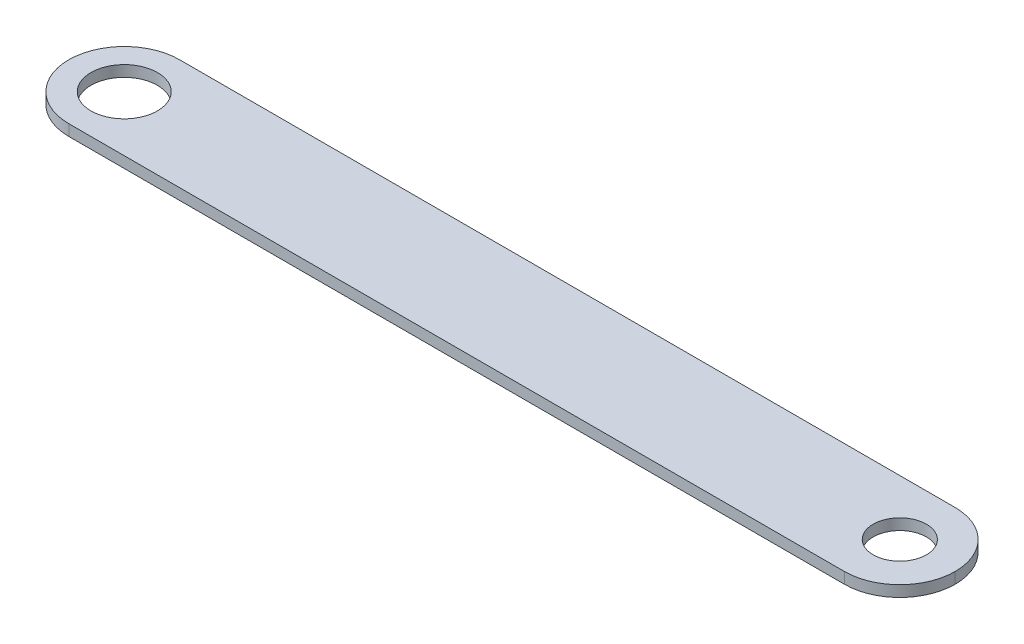
ISO-10303-21;
HEADER;
FILE_DESCRIPTION(('STEP AP214'),'2;1');
FILE_NAME('part.step','',(''),(''),'','','');
FILE_SCHEMA(('AUTOMOTIVE_DESIGN { 1 0 10303 214 1 1 1 1 }'));
ENDSEC;
DATA;
#1=APPLICATION_CONTEXT('core data for automotive mechanical design processes');
#2=APPLICATION_PROTOCOL_DEFINITION('international standard','automotive_design',2000,#1);
#3=PRODUCT_CONTEXT('',#1,'mechanical');
#4=PRODUCT('Part','Part','',(#3));
#5=PRODUCT_RELATED_PRODUCT_CATEGORY('part','',(#4));
#6=PRODUCT_DEFINITION_FORMATION('','',#4);
#7=PRODUCT_DEFINITION_CONTEXT('part definition',#1,'design');
#8=PRODUCT_DEFINITION('design','',#6,#7);
#9=PRODUCT_DEFINITION_SHAPE('','',#8);
#10=(LENGTH_UNIT() NAMED_UNIT(*) SI_UNIT(.MILLI.,.METRE.));
#11=(NAMED_UNIT(*) PLANE_ANGLE_UNIT() SI_UNIT($,.RADIAN.));
#12=(NAMED_UNIT(*) SI_UNIT($,.STERADIAN.) SOLID_ANGLE_UNIT());
#13=UNCERTAINTY_MEASURE_WITH_UNIT(LENGTH_MEASURE(1.E-05),#10,'distance_accuracy_value','');
#14=(GEOMETRIC_REPRESENTATION_CONTEXT(3) GLOBAL_UNCERTAINTY_ASSIGNED_CONTEXT((#13)) GLOBAL_UNIT_ASSIGNED_CONTEXT((#10,
#11,#12)) REPRESENTATION_CONTEXT('',''));
#15=CARTESIAN_POINT('',(0.,0.,0.));
#16=DIRECTION('',(0.,0.,1.));
#17=DIRECTION('',(1.,0.,0.));
#18=AXIS2_PLACEMENT_3D('',#15,#16,#17);
#19=CARTESIAN_POINT('',(0.,2.5,0.));
#20=DIRECTION('',(0.,1.,0.));
#21=DIRECTION('',(0.,0.,1.));
#22=AXIS2_PLACEMENT_3D('',#19,#20,#21);
#23=PLANE('',#22);
#24=CARTESIAN_POINT('',(-176.816523372745,2.5,-19.5438282647585));
#25=DIRECTION('',(0.,1.,0.));
#26=DIRECTION('',(0.,0.,1.));
#27=AXIS2_PLACEMENT_3D('',#24,#25,#26);
#28=CIRCLE('',#27,15.);
#29=CARTESIAN_POINT('',(-176.816523372745,2.5,-4.54382826475854));
#30=VERTEX_POINT('',#29);
#31=EDGE_CURVE('E166',#30,#30,#28,.T.);
#32=ORIENTED_EDGE('',*,*,#31,.F.);
#33=EDGE_LOOP('',(#32));
#34=FACE_BOUND('',#33,.T.);
#35=DIRECTION('',(1.,0.,0.));
#36=VECTOR('',#35,1.);
#37=CARTESIAN_POINT('',(-201.816523372745,2.5,5.45617173524147));
#38=LINE('',#37,#36);
#39=CARTESIAN_POINT('',(-176.816523372745,2.5,5.45617173524147));
#40=VERTEX_POINT('',#39);
#41=CARTESIAN_POINT('',(173.183476627255,2.5,5.45617173524147));
#42=VERTEX_POINT('',#41);
#43=EDGE_CURVE('E173',#40,#42,#38,.T.);
#44=ORIENTED_EDGE('',*,*,#43,.T.);
#45=CARTESIAN_POINT('',(173.183476627255,2.5,-19.5438282647585));
#46=DIRECTION('',(0.,1.,0.));
#47=DIRECTION('',(0.,0.,1.));
#48=AXIS2_PLACEMENT_3D('',#45,#46,#47);
#49=CIRCLE('',#48,25.);
#50=CARTESIAN_POINT('',(198.183476627255,2.5,-19.5438282647585));
#51=VERTEX_POINT('',#50);
#52=EDGE_CURVE('E145',#42,#51,#49,.T.);
#53=ORIENTED_EDGE('',*,*,#52,.T.);
#54=CARTESIAN_POINT('',(173.183476627255,2.5,-19.5438282647585));
#55=DIRECTION('',(0.,1.,0.));
#56=DIRECTION('',(0.,0.,1.));
#57=AXIS2_PLACEMENT_3D('',#54,#55,#56);
#58=CIRCLE('',#57,25.);
#59=CARTESIAN_POINT('',(173.183476627255,2.5,-44.5438282647585));
#60=VERTEX_POINT('',#59);
#61=EDGE_CURVE('E71',#51,#60,#58,.T.);
#62=ORIENTED_EDGE('',*,*,#61,.T.);
#63=DIRECTION('',(-1.,0.,0.));
#64=VECTOR('',#63,1.);
#65=CARTESIAN_POINT('',(-201.816523372745,2.5,-44.5438282647585));
#66=LINE('',#65,#64);
#67=CARTESIAN_POINT('',(-176.816523372745,2.5,-44.5438282647585));
#68=VERTEX_POINT('',#67);
#69=EDGE_CURVE('E115',#60,#68,#66,.T.);
#70=ORIENTED_EDGE('',*,*,#69,.T.);
#71=CARTESIAN_POINT('',(-176.816523372745,2.5,-19.5438282647585));
#72=DIRECTION('',(0.,1.,0.));
#73=DIRECTION('',(0.,0.,1.));
#74=AXIS2_PLACEMENT_3D('',#71,#72,#73);
#75=CIRCLE('',#74,25.);
#76=CARTESIAN_POINT('',(-201.816523372745,2.5,-19.5438282647585));
#77=VERTEX_POINT('',#76);
#78=EDGE_CURVE('E63',#68,#77,#75,.T.);
#79=ORIENTED_EDGE('',*,*,#78,.T.);
#80=CARTESIAN_POINT('',(-176.816523372745,2.5,-19.5438282647585));
#81=DIRECTION('',(0.,1.,0.));
#82=DIRECTION('',(0.,0.,1.));
#83=AXIS2_PLACEMENT_3D('',#80,#81,#82);
#84=CIRCLE('',#83,25.);
#85=EDGE_CURVE('E118',#77,#40,#84,.T.);
#86=ORIENTED_EDGE('',*,*,#85,.T.);
#87=EDGE_LOOP('',(#44,#53,#62,#70,#79,#86));
#88=FACE_BOUND('',#87,.T.);
#89=CARTESIAN_POINT('',(173.183476627255,2.5,-19.5438282647585));
#90=DIRECTION('',(0.,1.,0.));
#91=DIRECTION('',(0.,0.,1.));
#92=AXIS2_PLACEMENT_3D('',#89,#90,#91);
#93=CIRCLE('',#92,12.);
#94=CARTESIAN_POINT('',(173.183476627255,2.5,-7.54382826475853));
#95=VERTEX_POINT('',#94);
#96=EDGE_CURVE('E157',#95,#95,#93,.T.);
#97=ORIENTED_EDGE('',*,*,#96,.F.);
#98=EDGE_LOOP('',(#97));
#99=FACE_BOUND('',#98,.T.);
#100=ADVANCED_FACE('F45',(#34,#88,#99),#23,.T.);
#101=CARTESIAN_POINT('',(0.,-2.5,0.));
#102=DIRECTION('',(0.,1.,0.));
#103=DIRECTION('',(0.,0.,1.));
#104=AXIS2_PLACEMENT_3D('',#101,#102,#103);
#105=PLANE('',#104);
#106=CARTESIAN_POINT('',(173.183476627255,-2.5,-19.5438282647585));
#107=DIRECTION('',(0.,1.,0.));
#108=DIRECTION('',(0.,0.,1.));
#109=AXIS2_PLACEMENT_3D('',#106,#107,#108);
#110=CIRCLE('',#109,25.);
#111=CARTESIAN_POINT('',(173.183476627255,-2.5,-44.5438282647585));
#112=VERTEX_POINT('',#111);
#113=CARTESIAN_POINT('',(198.183476627255,-2.5,-19.5438282647585));
#114=VERTEX_POINT('',#113);
#115=EDGE_CURVE('E123',#112,#114,#110,.F.);
#116=ORIENTED_EDGE('',*,*,#115,.T.);
#117=CARTESIAN_POINT('',(173.183476627255,-2.5,-19.5438282647585));
#118=DIRECTION('',(0.,1.,0.));
#119=DIRECTION('',(0.,0.,1.));
#120=AXIS2_PLACEMENT_3D('',#117,#118,#119);
#121=CIRCLE('',#120,25.);
#122=CARTESIAN_POINT('',(173.183476627255,-2.5,5.45617173524147));
#123=VERTEX_POINT('',#122);
#124=EDGE_CURVE('E126',#114,#123,#121,.F.);
#125=ORIENTED_EDGE('',*,*,#124,.T.);
#126=DIRECTION('',(1.,0.,0.));
#127=VECTOR('',#126,1.);
#128=CARTESIAN_POINT('',(-201.816523372745,-2.5,5.45617173524147));
#129=LINE('',#128,#127);
#130=CARTESIAN_POINT('',(-176.816523372745,-2.5,5.45617173524147));
#131=VERTEX_POINT('',#130);
#132=EDGE_CURVE('E111',#131,#123,#129,.T.);
#133=ORIENTED_EDGE('',*,*,#132,.F.);
#134=CARTESIAN_POINT('',(-176.816523372745,-2.5,-19.5438282647585));
#135=DIRECTION('',(0.,1.,0.));
#136=DIRECTION('',(0.,0.,1.));
#137=AXIS2_PLACEMENT_3D('',#134,#135,#136);
#138=CIRCLE('',#137,25.);
#139=CARTESIAN_POINT('',(-201.816523372745,-2.5,-19.5438282647585));
#140=VERTEX_POINT('',#139);
#141=EDGE_CURVE('E102',#131,#140,#138,.F.);
#142=ORIENTED_EDGE('',*,*,#141,.T.);
#143=CARTESIAN_POINT('',(-176.816523372745,-2.5,-19.5438282647585));
#144=DIRECTION('',(0.,1.,0.));
#145=DIRECTION('',(0.,0.,1.));
#146=AXIS2_PLACEMENT_3D('',#143,#144,#145);
#147=CIRCLE('',#146,25.);
#148=CARTESIAN_POINT('',(-176.816523372745,-2.5,-44.5438282647585));
#149=VERTEX_POINT('',#148);
#150=EDGE_CURVE('E108',#140,#149,#147,.F.);
#151=ORIENTED_EDGE('',*,*,#150,.T.);
#152=DIRECTION('',(-1.,0.,0.));
#153=VECTOR('',#152,1.);
#154=CARTESIAN_POINT('',(-201.816523372745,-2.5,-44.5438282647585));
#155=LINE('',#154,#153);
#156=EDGE_CURVE('E177',#112,#149,#155,.T.);
#157=ORIENTED_EDGE('',*,*,#156,.F.);
#158=EDGE_LOOP('',(#116,#125,#133,#142,#151,#157));
#159=FACE_BOUND('',#158,.T.);
#160=CARTESIAN_POINT('',(-176.816523372745,-2.5,-19.5438282647585));
#161=DIRECTION('',(0.,1.,0.));
#162=DIRECTION('',(0.,0.,1.));
#163=AXIS2_PLACEMENT_3D('',#160,#161,#162);
#164=CIRCLE('',#163,15.);
#165=CARTESIAN_POINT('',(-176.816523372745,-2.5,-4.54382826475854));
#166=VERTEX_POINT('',#165);
#167=EDGE_CURVE('E163',#166,#166,#164,.T.);
#168=ORIENTED_EDGE('',*,*,#167,.T.);
#169=EDGE_LOOP('',(#168));
#170=FACE_BOUND('',#169,.T.);
#171=CARTESIAN_POINT('',(173.183476627255,-2.5,-19.5438282647585));
#172=DIRECTION('',(0.,1.,0.));
#173=DIRECTION('',(0.,0.,1.));
#174=AXIS2_PLACEMENT_3D('',#171,#172,#173);
#175=CIRCLE('',#174,12.);
#176=CARTESIAN_POINT('',(173.183476627255,-2.5,-7.54382826475853));
#177=VERTEX_POINT('',#176);
#178=EDGE_CURVE('E151',#177,#177,#175,.T.);
#179=ORIENTED_EDGE('',*,*,#178,.T.);
#180=EDGE_LOOP('',(#179));
#181=FACE_BOUND('',#180,.T.);
#182=ADVANCED_FACE('F104',(#159,#170,#181),#105,.F.);
#183=CARTESIAN_POINT('',(-201.816523372745,2.5,5.45617173524147));
#184=DIRECTION('',(0.,0.,-1.));
#185=DIRECTION('',(-1.,0.,0.));
#186=AXIS2_PLACEMENT_3D('',#183,#184,#185);
#187=PLANE('',#186);
#188=ORIENTED_EDGE('',*,*,#132,.T.);
#189=DIRECTION('',(0.,-1.,0.));
#190=VECTOR('',#189,1.);
#191=CARTESIAN_POINT('',(173.183476627255,2.5,5.45617173524147));
#192=LINE('',#191,#190);
#193=EDGE_CURVE('E135',#123,#42,#192,.F.);
#194=ORIENTED_EDGE('',*,*,#193,.T.);
#195=ORIENTED_EDGE('',*,*,#43,.F.);
#196=DIRECTION('',(0.,-1.,0.));
#197=VECTOR('',#196,1.);
#198=CARTESIAN_POINT('',(-176.816523372745,2.5,5.45617173524147));
#199=LINE('',#198,#197);
#200=EDGE_CURVE('E132',#40,#131,#199,.T.);
#201=ORIENTED_EDGE('',*,*,#200,.T.);
#202=EDGE_LOOP('',(#188,#194,#195,#201));
#203=FACE_BOUND('',#202,.T.);
#204=ADVANCED_FACE('F191',(#203),#187,.F.);
#205=CARTESIAN_POINT('',(-201.816523372745,2.5,-44.5438282647585));
#206=DIRECTION('',(0.,0.,1.));
#207=DIRECTION('',(1.,0.,0.));
#208=AXIS2_PLACEMENT_3D('',#205,#206,#207);
#209=PLANE('',#208);
#210=ORIENTED_EDGE('',*,*,#69,.F.);
#211=DIRECTION('',(0.,-1.,0.));
#212=VECTOR('',#211,1.);
#213=CARTESIAN_POINT('',(173.183476627255,2.5,-44.5438282647585));
#214=LINE('',#213,#212);
#215=EDGE_CURVE('E11',#60,#112,#214,.T.);
#216=ORIENTED_EDGE('',*,*,#215,.T.);
#217=ORIENTED_EDGE('',*,*,#156,.T.);
#218=DIRECTION('',(0.,-1.,0.));
#219=VECTOR('',#218,1.);
#220=CARTESIAN_POINT('',(-176.816523372745,2.5,-44.5438282647585));
#221=LINE('',#220,#219);
#222=EDGE_CURVE('E55',#149,#68,#221,.F.);
#223=ORIENTED_EDGE('',*,*,#222,.T.);
#224=EDGE_LOOP('',(#210,#216,#217,#223));
#225=FACE_BOUND('',#224,.T.);
#226=ADVANCED_FACE('F183',(#225),#209,.F.);
#227=CARTESIAN_POINT('',(-176.816523372745,2.5,-19.5438282647585));
#228=DIRECTION('',(0.,-1.,0.));
#229=DIRECTION('',(0.,0.,-1.));
#230=AXIS2_PLACEMENT_3D('',#227,#228,#229);
#231=CYLINDRICAL_SURFACE('',#230,15.);
#232=ORIENTED_EDGE('',*,*,#31,.T.);
#233=EDGE_LOOP('',(#232));
#234=FACE_BOUND('',#233,.T.);
#235=ORIENTED_EDGE('',*,*,#167,.F.);
#236=EDGE_LOOP('',(#235));
#237=FACE_BOUND('',#236,.T.);
#238=ADVANCED_FACE('F202',(#234,#237),#231,.F.);
#239=CARTESIAN_POINT('',(173.183476627255,2.5,-19.5438282647585));
#240=DIRECTION('',(0.,-1.,0.));
#241=DIRECTION('',(0.,0.,-1.));
#242=AXIS2_PLACEMENT_3D('',#239,#240,#241);
#243=CYLINDRICAL_SURFACE('',#242,12.);
#244=ORIENTED_EDGE('',*,*,#96,.T.);
#245=EDGE_LOOP('',(#244));
#246=FACE_BOUND('',#245,.T.);
#247=ORIENTED_EDGE('',*,*,#178,.F.);
#248=EDGE_LOOP('',(#247));
#249=FACE_BOUND('',#248,.T.);
#250=ADVANCED_FACE('F199',(#246,#249),#243,.F.);
#251=CARTESIAN_POINT('',(173.183476627255,2.5,-19.5438282647585));
#252=DIRECTION('',(0.,-1.,0.));
#253=DIRECTION('',(0.,0.,-1.));
#254=AXIS2_PLACEMENT_3D('',#251,#252,#253);
#255=CYLINDRICAL_SURFACE('',#254,25.);
#256=ORIENTED_EDGE('',*,*,#215,.F.);
#257=ORIENTED_EDGE('',*,*,#61,.F.);
#258=DIRECTION('',(0.,-1.,0.));
#259=VECTOR('',#258,1.);
#260=CARTESIAN_POINT('',(198.183476627255,2.5,-19.5438282647585));
#261=LINE('',#260,#259);
#262=EDGE_CURVE('E120',#114,#51,#261,.F.);
#263=ORIENTED_EDGE('',*,*,#262,.F.);
#264=ORIENTED_EDGE('',*,*,#115,.F.);
#265=EDGE_LOOP('',(#256,#257,#263,#264));
#266=FACE_BOUND('',#265,.T.);
#267=ADVANCED_FACE('F187',(#266),#255,.T.);
#268=CARTESIAN_POINT('',(173.183476627255,2.5,-19.5438282647585));
#269=DIRECTION('',(0.,-1.,0.));
#270=DIRECTION('',(0.,0.,-1.));
#271=AXIS2_PLACEMENT_3D('',#268,#269,#270);
#272=CYLINDRICAL_SURFACE('',#271,25.);
#273=ORIENTED_EDGE('',*,*,#52,.F.);
#274=ORIENTED_EDGE('',*,*,#193,.F.);
#275=ORIENTED_EDGE('',*,*,#124,.F.);
#276=ORIENTED_EDGE('',*,*,#262,.T.);
#277=EDGE_LOOP('',(#273,#274,#275,#276));
#278=FACE_BOUND('',#277,.T.);
#279=ADVANCED_FACE('F189',(#278),#272,.T.);
#280=CARTESIAN_POINT('',(-176.816523372745,2.5,-19.5438282647585));
#281=DIRECTION('',(0.,-1.,0.));
#282=DIRECTION('',(0.,0.,-1.));
#283=AXIS2_PLACEMENT_3D('',#280,#281,#282);
#284=CYLINDRICAL_SURFACE('',#283,25.);
#285=ORIENTED_EDGE('',*,*,#200,.F.);
#286=ORIENTED_EDGE('',*,*,#85,.F.);
#287=DIRECTION('',(0.,-1.,0.));
#288=VECTOR('',#287,1.);
#289=CARTESIAN_POINT('',(-201.816523372745,2.5,-19.5438282647585));
#290=LINE('',#289,#288);
#291=EDGE_CURVE('E49',#140,#77,#290,.F.);
#292=ORIENTED_EDGE('',*,*,#291,.F.);
#293=ORIENTED_EDGE('',*,*,#141,.F.);
#294=EDGE_LOOP('',(#285,#286,#292,#293));
#295=FACE_BOUND('',#294,.T.);
#296=ADVANCED_FACE('F47',(#295),#284,.T.);
#297=CARTESIAN_POINT('',(-176.816523372745,2.5,-19.5438282647585));
#298=DIRECTION('',(0.,-1.,0.));
#299=DIRECTION('',(0.,0.,-1.));
#300=AXIS2_PLACEMENT_3D('',#297,#298,#299);
#301=CYLINDRICAL_SURFACE('',#300,25.);
#302=ORIENTED_EDGE('',*,*,#78,.F.);
#303=ORIENTED_EDGE('',*,*,#222,.F.);
#304=ORIENTED_EDGE('',*,*,#150,.F.);
#305=ORIENTED_EDGE('',*,*,#291,.T.);
#306=EDGE_LOOP('',(#302,#303,#304,#305));
#307=FACE_BOUND('',#306,.T.);
#308=ADVANCED_FACE('F121',(#307),#301,.T.);
#309=CLOSED_SHELL('',(#100,#182,#204,#226,#238,#250,#267,#279,#296,#308));
#310=MANIFOLD_SOLID_BREP('B2',#309);
#311=ADVANCED_BREP_SHAPE_REPRESENTATION('',(#18,#310),#14);
#312=SHAPE_DEFINITION_REPRESENTATION(#9,#311);
ENDSEC;
END-ISO-10303-21;
